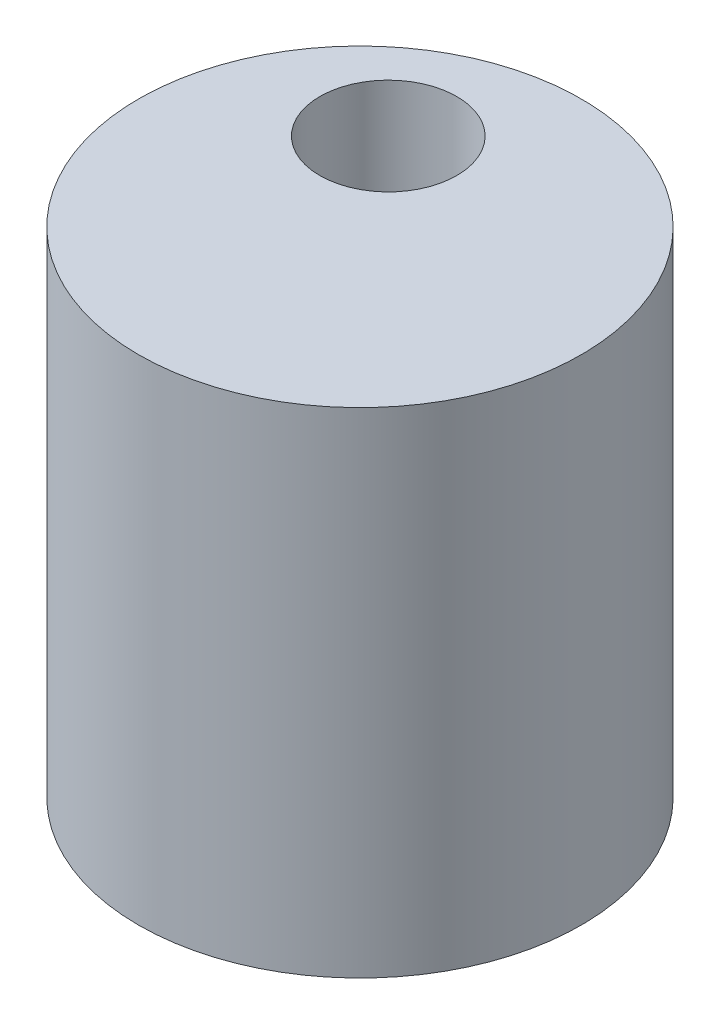
ISO-10303-21;
HEADER;
FILE_DESCRIPTION(('STEP AP214'),'2;1');
FILE_NAME('part.step','',(''),(''),'','','');
FILE_SCHEMA(('AUTOMOTIVE_DESIGN { 1 0 10303 214 1 1 1 1 }'));
ENDSEC;
DATA;
#1=APPLICATION_CONTEXT('core data for automotive mechanical design processes');
#2=APPLICATION_PROTOCOL_DEFINITION('international standard','automotive_design',2000,#1);
#3=PRODUCT_CONTEXT('',#1,'mechanical');
#4=PRODUCT('Part','Part','',(#3));
#5=PRODUCT_RELATED_PRODUCT_CATEGORY('part','',(#4));
#6=PRODUCT_DEFINITION_FORMATION('','',#4);
#7=PRODUCT_DEFINITION_CONTEXT('part definition',#1,'design');
#8=PRODUCT_DEFINITION('design','',#6,#7);
#9=PRODUCT_DEFINITION_SHAPE('','',#8);
#10=(LENGTH_UNIT() NAMED_UNIT(*) SI_UNIT(.MILLI.,.METRE.));
#11=(NAMED_UNIT(*) PLANE_ANGLE_UNIT() SI_UNIT($,.RADIAN.));
#12=(NAMED_UNIT(*) SI_UNIT($,.STERADIAN.) SOLID_ANGLE_UNIT());
#13=UNCERTAINTY_MEASURE_WITH_UNIT(LENGTH_MEASURE(1.E-05),#10,'distance_accuracy_value','');
#14=(GEOMETRIC_REPRESENTATION_CONTEXT(3) GLOBAL_UNCERTAINTY_ASSIGNED_CONTEXT((#13)) GLOBAL_UNIT_ASSIGNED_CONTEXT((#10,
#11,#12)) REPRESENTATION_CONTEXT('',''));
#15=CARTESIAN_POINT('',(0.,0.,0.));
#16=DIRECTION('',(0.,0.,1.));
#17=DIRECTION('',(1.,0.,0.));
#18=AXIS2_PLACEMENT_3D('',#15,#16,#17);
#19=CARTESIAN_POINT('',(0.,-29.21,0.));
#20=DIRECTION('',(0.,1.,0.));
#21=DIRECTION('',(0.,0.,1.));
#22=AXIS2_PLACEMENT_3D('',#19,#20,#21);
#23=CYLINDRICAL_SURFACE('',#22,13.0937);
#24=CARTESIAN_POINT('',(0.,-29.21,0.));
#25=DIRECTION('',(0.,1.,0.));
#26=DIRECTION('',(0.,0.,1.));
#27=AXIS2_PLACEMENT_3D('',#24,#25,#26);
#28=CIRCLE('',#27,13.0937);
#29=CARTESIAN_POINT('',(0.,-29.21,13.0937));
#30=VERTEX_POINT('',#29);
#31=EDGE_CURVE('E10',#30,#30,#28,.T.);
#32=ORIENTED_EDGE('',*,*,#31,.T.);
#33=EDGE_LOOP('',(#32));
#34=FACE_BOUND('',#33,.T.);
#35=CARTESIAN_POINT('',(0.,0.,0.));
#36=DIRECTION('',(0.,1.,0.));
#37=DIRECTION('',(0.,0.,1.));
#38=AXIS2_PLACEMENT_3D('',#35,#36,#37);
#39=CIRCLE('',#38,13.0937);
#40=CARTESIAN_POINT('',(0.,0.,13.0937));
#41=VERTEX_POINT('',#40);
#42=EDGE_CURVE('E40',#41,#41,#39,.T.);
#43=ORIENTED_EDGE('',*,*,#42,.F.);
#44=EDGE_LOOP('',(#43));
#45=FACE_BOUND('',#44,.T.);
#46=ADVANCED_FACE('F37',(#34,#45),#23,.T.);
#47=CARTESIAN_POINT('',(0.,-29.21,0.));
#48=DIRECTION('',(0.,1.,0.));
#49=DIRECTION('',(0.,0.,1.));
#50=AXIS2_PLACEMENT_3D('',#47,#48,#49);
#51=PLANE('',#50);
#52=CARTESIAN_POINT('',(-3.81,-29.21,-5.4864));
#53=DIRECTION('',(0.,1.,0.));
#54=DIRECTION('',(0.,0.,1.));
#55=AXIS2_PLACEMENT_3D('',#52,#53,#54);
#56=CIRCLE('',#55,4.05);
#57=CARTESIAN_POINT('',(-3.81,-29.21,-1.4364));
#58=VERTEX_POINT('',#57);
#59=EDGE_CURVE('E49',#58,#58,#56,.T.);
#60=ORIENTED_EDGE('',*,*,#59,.T.);
#61=EDGE_LOOP('',(#60));
#62=FACE_BOUND('',#61,.T.);
#63=ORIENTED_EDGE('',*,*,#31,.F.);
#64=EDGE_LOOP('',(#63));
#65=FACE_BOUND('',#64,.T.);
#66=ADVANCED_FACE('F59',(#62,#65),#51,.F.);
#67=CARTESIAN_POINT('',(0.,0.,0.));
#68=DIRECTION('',(0.,1.,0.));
#69=DIRECTION('',(0.,0.,1.));
#70=AXIS2_PLACEMENT_3D('',#67,#68,#69);
#71=PLANE('',#70);
#72=CARTESIAN_POINT('',(-3.81,0.,-5.4864));
#73=DIRECTION('',(0.,1.,0.));
#74=DIRECTION('',(0.,0.,1.));
#75=AXIS2_PLACEMENT_3D('',#72,#73,#74);
#76=CIRCLE('',#75,4.05);
#77=CARTESIAN_POINT('',(-3.81,0.,-1.4364));
#78=VERTEX_POINT('',#77);
#79=EDGE_CURVE('E51',#78,#78,#76,.T.);
#80=ORIENTED_EDGE('',*,*,#79,.F.);
#81=EDGE_LOOP('',(#80));
#82=FACE_BOUND('',#81,.T.);
#83=ORIENTED_EDGE('',*,*,#42,.T.);
#84=EDGE_LOOP('',(#83));
#85=FACE_BOUND('',#84,.T.);
#86=ADVANCED_FACE('F65',(#82,#85),#71,.T.);
#87=CARTESIAN_POINT('',(-3.81,-29.21,-5.4864));
#88=DIRECTION('',(0.,1.,0.));
#89=DIRECTION('',(0.,0.,1.));
#90=AXIS2_PLACEMENT_3D('',#87,#88,#89);
#91=CYLINDRICAL_SURFACE('',#90,4.05);
#92=ORIENTED_EDGE('',*,*,#59,.F.);
#93=EDGE_LOOP('',(#92));
#94=FACE_BOUND('',#93,.T.);
#95=ORIENTED_EDGE('',*,*,#79,.T.);
#96=EDGE_LOOP('',(#95));
#97=FACE_BOUND('',#96,.T.);
#98=ADVANCED_FACE('F62',(#94,#97),#91,.F.);
#99=CLOSED_SHELL('',(#46,#66,#86,#98));
#100=MANIFOLD_SOLID_BREP('B2',#99);
#101=ADVANCED_BREP_SHAPE_REPRESENTATION('',(#18,#100),#14);
#102=SHAPE_DEFINITION_REPRESENTATION(#9,#101);
ENDSEC;
END-ISO-10303-21;
